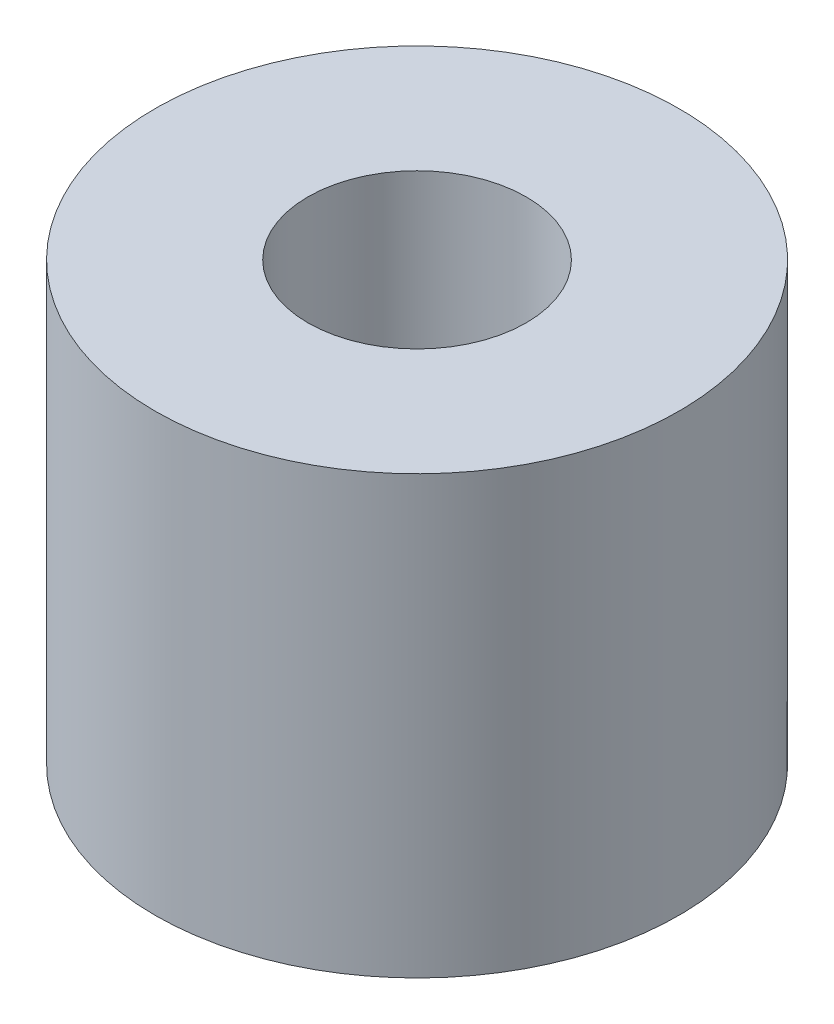
ISO-10303-21;
HEADER;
FILE_DESCRIPTION(('STEP AP214'),'2;1');
FILE_NAME('part.step','',(''),(''),'','','');
FILE_SCHEMA(('AUTOMOTIVE_DESIGN { 1 0 10303 214 1 1 1 1 }'));
ENDSEC;
DATA;
#1=APPLICATION_CONTEXT('core data for automotive mechanical design processes');
#2=APPLICATION_PROTOCOL_DEFINITION('international standard','automotive_design',2000,#1);
#3=PRODUCT_CONTEXT('',#1,'mechanical');
#4=PRODUCT('Part','Part','',(#3));
#5=PRODUCT_RELATED_PRODUCT_CATEGORY('part','',(#4));
#6=PRODUCT_DEFINITION_FORMATION('','',#4);
#7=PRODUCT_DEFINITION_CONTEXT('part definition',#1,'design');
#8=PRODUCT_DEFINITION('design','',#6,#7);
#9=PRODUCT_DEFINITION_SHAPE('','',#8);
#10=(LENGTH_UNIT() NAMED_UNIT(*) SI_UNIT(.MILLI.,.METRE.));
#11=(NAMED_UNIT(*) PLANE_ANGLE_UNIT() SI_UNIT($,.RADIAN.));
#12=(NAMED_UNIT(*) SI_UNIT($,.STERADIAN.) SOLID_ANGLE_UNIT());
#13=UNCERTAINTY_MEASURE_WITH_UNIT(LENGTH_MEASURE(1.E-05),#10,'distance_accuracy_value','');
#14=(GEOMETRIC_REPRESENTATION_CONTEXT(3) GLOBAL_UNCERTAINTY_ASSIGNED_CONTEXT((#13)) GLOBAL_UNIT_ASSIGNED_CONTEXT((#10,
#11,#12)) REPRESENTATION_CONTEXT('',''));
#15=CARTESIAN_POINT('',(0.,0.,0.));
#16=DIRECTION('',(0.,0.,1.));
#17=DIRECTION('',(1.,0.,0.));
#18=AXIS2_PLACEMENT_3D('',#15,#16,#17);
#19=CARTESIAN_POINT('',(0.,6.35,0.));
#20=DIRECTION('',(0.,1.,0.));
#21=DIRECTION('',(0.,0.,1.));
#22=AXIS2_PLACEMENT_3D('',#19,#20,#21);
#23=PLANE('',#22);
#24=CARTESIAN_POINT('',(0.,6.35,0.));
#25=DIRECTION('',(0.,1.,0.));
#26=DIRECTION('',(0.,0.,1.));
#27=AXIS2_PLACEMENT_3D('',#24,#25,#26);
#28=CIRCLE('',#27,3.81);
#29=CARTESIAN_POINT('',(0.,6.35,3.81));
#30=VERTEX_POINT('',#29);
#31=EDGE_CURVE('E10',#30,#30,#28,.T.);
#32=ORIENTED_EDGE('',*,*,#31,.T.);
#33=EDGE_LOOP('',(#32));
#34=FACE_BOUND('',#33,.T.);
#35=CARTESIAN_POINT('',(0.,6.35,0.));
#36=DIRECTION('',(0.,1.,0.));
#37=DIRECTION('',(0.,0.,1.));
#38=AXIS2_PLACEMENT_3D('',#35,#36,#37);
#39=CIRCLE('',#38,1.5875);
#40=CARTESIAN_POINT('',(0.,6.35,1.5875));
#41=VERTEX_POINT('',#40);
#42=EDGE_CURVE('E42',#41,#41,#39,.T.);
#43=ORIENTED_EDGE('',*,*,#42,.F.);
#44=EDGE_LOOP('',(#43));
#45=FACE_BOUND('',#44,.T.);
#46=ADVANCED_FACE('F31',(#34,#45),#23,.T.);
#47=CARTESIAN_POINT('',(0.,0.,0.));
#48=DIRECTION('',(0.,1.,0.));
#49=DIRECTION('',(0.,0.,1.));
#50=AXIS2_PLACEMENT_3D('',#47,#48,#49);
#51=PLANE('',#50);
#52=CARTESIAN_POINT('',(0.,0.,0.));
#53=DIRECTION('',(0.,1.,0.));
#54=DIRECTION('',(0.,0.,1.));
#55=AXIS2_PLACEMENT_3D('',#52,#53,#54);
#56=CIRCLE('',#55,3.81);
#57=CARTESIAN_POINT('',(0.,0.,3.81));
#58=VERTEX_POINT('',#57);
#59=EDGE_CURVE('E35',#58,#58,#56,.T.);
#60=ORIENTED_EDGE('',*,*,#59,.F.);
#61=EDGE_LOOP('',(#60));
#62=FACE_BOUND('',#61,.T.);
#63=CARTESIAN_POINT('',(0.,0.,0.));
#64=DIRECTION('',(0.,1.,0.));
#65=DIRECTION('',(0.,0.,1.));
#66=AXIS2_PLACEMENT_3D('',#63,#64,#65);
#67=CIRCLE('',#66,1.5875);
#68=CARTESIAN_POINT('',(0.,0.,1.5875));
#69=VERTEX_POINT('',#68);
#70=EDGE_CURVE('E44',#69,#69,#67,.T.);
#71=ORIENTED_EDGE('',*,*,#70,.T.);
#72=EDGE_LOOP('',(#71));
#73=FACE_BOUND('',#72,.T.);
#74=ADVANCED_FACE('F54',(#62,#73),#51,.F.);
#75=CARTESIAN_POINT('',(0.,6.35,0.));
#76=DIRECTION('',(0.,-1.,0.));
#77=DIRECTION('',(0.,0.,-1.));
#78=AXIS2_PLACEMENT_3D('',#75,#76,#77);
#79=CYLINDRICAL_SURFACE('',#78,3.81);
#80=ORIENTED_EDGE('',*,*,#31,.F.);
#81=EDGE_LOOP('',(#80));
#82=FACE_BOUND('',#81,.T.);
#83=ORIENTED_EDGE('',*,*,#59,.T.);
#84=EDGE_LOOP('',(#83));
#85=FACE_BOUND('',#84,.T.);
#86=ADVANCED_FACE('F33',(#82,#85),#79,.T.);
#87=CARTESIAN_POINT('',(0.,6.35,0.));
#88=DIRECTION('',(0.,-1.,0.));
#89=DIRECTION('',(0.,0.,-1.));
#90=AXIS2_PLACEMENT_3D('',#87,#88,#89);
#91=CYLINDRICAL_SURFACE('',#90,1.5875);
#92=ORIENTED_EDGE('',*,*,#42,.T.);
#93=EDGE_LOOP('',(#92));
#94=FACE_BOUND('',#93,.T.);
#95=ORIENTED_EDGE('',*,*,#70,.F.);
#96=EDGE_LOOP('',(#95));
#97=FACE_BOUND('',#96,.T.);
#98=ADVANCED_FACE('F50',(#94,#97),#91,.F.);
#99=CLOSED_SHELL('',(#46,#74,#86,#98));
#100=MANIFOLD_SOLID_BREP('B2',#99);
#101=ADVANCED_BREP_SHAPE_REPRESENTATION('',(#18,#100),#14);
#102=SHAPE_DEFINITION_REPRESENTATION(#9,#101);
ENDSEC;
END-ISO-10303-21;
